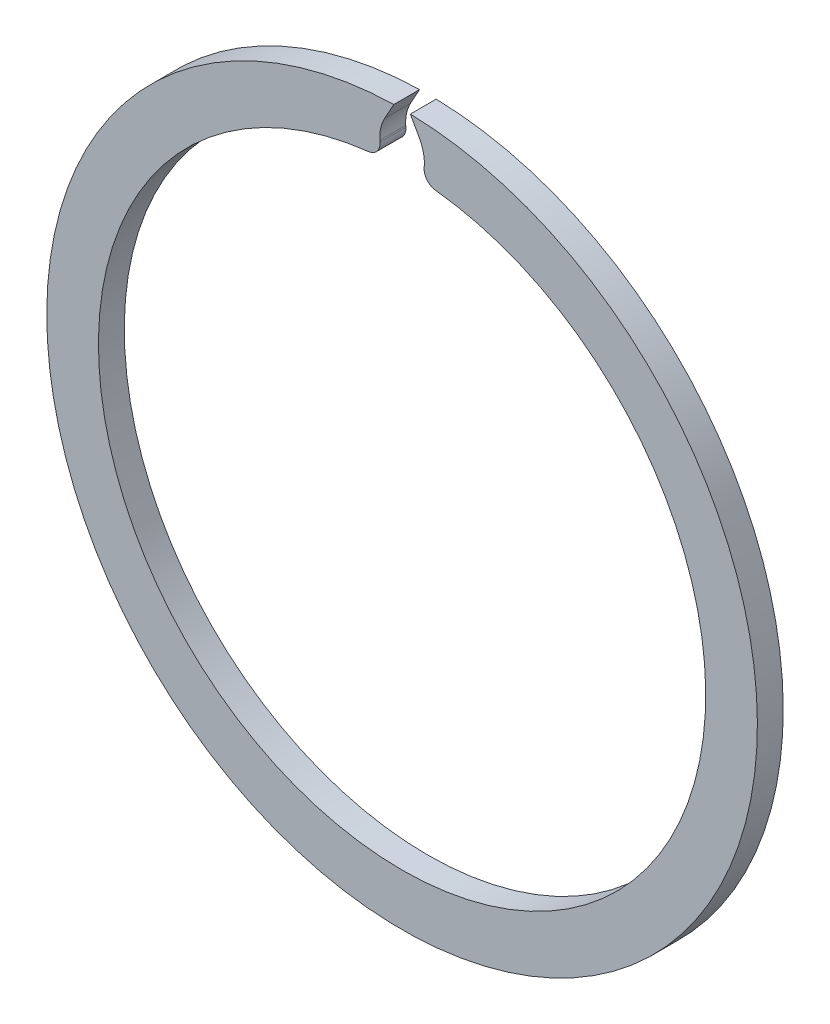
ISO-10303-21;
HEADER;
FILE_DESCRIPTION(('STEP AP214'),'2;1');
FILE_NAME('part.step','',(''),(''),'','','');
FILE_SCHEMA(('AUTOMOTIVE_DESIGN { 1 0 10303 214 1 1 1 1 }'));
ENDSEC;
DATA;
#1=APPLICATION_CONTEXT('core data for automotive mechanical design processes');
#2=APPLICATION_PROTOCOL_DEFINITION('international standard','automotive_design',2000,#1);
#3=PRODUCT_CONTEXT('',#1,'mechanical');
#4=PRODUCT('Part','Part','',(#3));
#5=PRODUCT_RELATED_PRODUCT_CATEGORY('part','',(#4));
#6=PRODUCT_DEFINITION_FORMATION('','',#4);
#7=PRODUCT_DEFINITION_CONTEXT('part definition',#1,'design');
#8=PRODUCT_DEFINITION('design','',#6,#7);
#9=PRODUCT_DEFINITION_SHAPE('','',#8);
#10=(LENGTH_UNIT() NAMED_UNIT(*) SI_UNIT(.MILLI.,.METRE.));
#11=(NAMED_UNIT(*) PLANE_ANGLE_UNIT() SI_UNIT($,.RADIAN.));
#12=(NAMED_UNIT(*) SI_UNIT($,.STERADIAN.) SOLID_ANGLE_UNIT());
#13=UNCERTAINTY_MEASURE_WITH_UNIT(LENGTH_MEASURE(1.E-05),#10,'distance_accuracy_value','');
#14=(GEOMETRIC_REPRESENTATION_CONTEXT(3) GLOBAL_UNCERTAINTY_ASSIGNED_CONTEXT((#13)) GLOBAL_UNIT_ASSIGNED_CONTEXT((#10,
#11,#12)) REPRESENTATION_CONTEXT('',''));
#15=CARTESIAN_POINT('',(0.,0.,0.));
#16=DIRECTION('',(0.,0.,1.));
#17=DIRECTION('',(1.,0.,0.));
#18=AXIS2_PLACEMENT_3D('',#15,#16,#17);
#19=CARTESIAN_POINT('',(-2.70517346207127,24.3501958213914,2.));
#20=DIRECTION('',(0.,0.,-1.));
#21=DIRECTION('',(-1.,0.,0.));
#22=AXIS2_PLACEMENT_3D('',#19,#20,#21);
#23=CYLINDRICAL_SURFACE('',#22,1.);
#24=CARTESIAN_POINT('',(-2.70517346207127,24.3501958213914,0.));
#25=DIRECTION('',(0.,0.,1.));
#26=DIRECTION('',(-1.,0.,0.));
#27=AXIS2_PLACEMENT_3D('',#24,#25,#26);
#28=CIRCLE('',#27,1.);
#29=CARTESIAN_POINT('',(-2.59475821872142,23.3563102776611,0.));
#30=VERTEX_POINT('',#29);
#31=CARTESIAN_POINT('',(-1.70760941181144,24.4199522951355,0.));
#32=VERTEX_POINT('',#31);
#33=EDGE_CURVE('E141',#30,#32,#28,.T.);
#34=ORIENTED_EDGE('',*,*,#33,.T.);
#35=DIRECTION('',(0.,0.,-1.));
#36=VECTOR('',#35,1.);
#37=CARTESIAN_POINT('',(-1.70760941181144,24.4199522951355,2.));
#38=LINE('',#37,#36);
#39=CARTESIAN_POINT('',(-1.70760941181144,24.4199522951355,2.));
#40=VERTEX_POINT('',#39);
#41=EDGE_CURVE('E11',#40,#32,#38,.T.);
#42=ORIENTED_EDGE('',*,*,#41,.F.);
#43=CARTESIAN_POINT('',(-2.70517346207127,24.3501958213914,2.));
#44=DIRECTION('',(0.,0.,1.));
#45=DIRECTION('',(-1.,0.,0.));
#46=AXIS2_PLACEMENT_3D('',#43,#44,#45);
#47=CIRCLE('',#46,1.);
#48=CARTESIAN_POINT('',(-2.59475821872142,23.3563102776611,2.));
#49=VERTEX_POINT('',#48);
#50=EDGE_CURVE('E159',#49,#40,#47,.T.);
#51=ORIENTED_EDGE('',*,*,#50,.F.);
#52=DIRECTION('',(0.,0.,-1.));
#53=VECTOR('',#52,1.);
#54=CARTESIAN_POINT('',(-2.59475821872142,23.3563102776611,2.));
#55=LINE('',#54,#53);
#56=EDGE_CURVE('E137',#49,#30,#55,.T.);
#57=ORIENTED_EDGE('',*,*,#56,.T.);
#58=EDGE_LOOP('',(#34,#42,#51,#57));
#59=FACE_BOUND('',#58,.T.);
#60=ADVANCED_FACE('F33',(#59),#23,.T.);
#61=CARTESIAN_POINT('',(-1.70760941181144,24.4199522951355,2.));
#62=DIRECTION('',(-0.997564050259824,-0.069756473744125,0.));
#63=DIRECTION('',(0.069756473744125,-0.997564050259824,0.));
#64=AXIS2_PLACEMENT_3D('',#61,#62,#63);
#65=PLANE('',#64);
#66=DIRECTION('',(-0.069756473744125,0.997564050259824,0.));
#67=VECTOR('',#66,1.);
#68=CARTESIAN_POINT('',(-1.70760941181144,24.4199522951355,0.));
#69=LINE('',#68,#67);
#70=CARTESIAN_POINT('',(-1.71680165382327,24.5514074802975,0.));
#71=VERTEX_POINT('',#70);
#72=EDGE_CURVE('E144',#32,#71,#69,.T.);
#73=ORIENTED_EDGE('',*,*,#72,.T.);
#74=DIRECTION('',(0.,0.,-1.));
#75=VECTOR('',#74,1.);
#76=CARTESIAN_POINT('',(-1.71680165382327,24.5514074802975,2.));
#77=LINE('',#76,#75);
#78=CARTESIAN_POINT('',(-1.71680165382327,24.5514074802975,2.));
#79=VERTEX_POINT('',#78);
#80=EDGE_CURVE('E41',#79,#71,#77,.T.);
#81=ORIENTED_EDGE('',*,*,#80,.F.);
#82=DIRECTION('',(-0.069756473744125,0.997564050259824,0.));
#83=VECTOR('',#82,1.);
#84=CARTESIAN_POINT('',(-1.70760941181144,24.4199522951355,2.));
#85=LINE('',#84,#83);
#86=EDGE_CURVE('E98',#40,#79,#85,.T.);
#87=ORIENTED_EDGE('',*,*,#86,.F.);
#88=ORIENTED_EDGE('',*,*,#41,.T.);
#89=EDGE_LOOP('',(#73,#81,#87,#88));
#90=FACE_BOUND('',#89,.T.);
#91=ADVANCED_FACE('F208',(#90),#65,.F.);
#92=CARTESIAN_POINT('',(1.2758904969562,24.7606769015299,2.));
#93=DIRECTION('',(0.,0.,-1.));
#94=DIRECTION('',(-1.,0.,0.));
#95=AXIS2_PLACEMENT_3D('',#92,#93,#94);
#96=CYLINDRICAL_SURFACE('',#95,3.);
#97=CARTESIAN_POINT('',(1.2758904969562,24.7606769015299,0.));
#98=DIRECTION('',(0.,0.,-1.));
#99=DIRECTION('',(1.,0.,0.));
#100=AXIS2_PLACEMENT_3D('',#97,#98,#99);
#101=CIRCLE('',#100,3.);
#102=CARTESIAN_POINT('',(-1.34796862446198,26.2151057622689,0.));
#103=VERTEX_POINT('',#102);
#104=EDGE_CURVE('E146',#71,#103,#101,.T.);
#105=ORIENTED_EDGE('',*,*,#104,.T.);
#106=DIRECTION('',(0.,0.,-1.));
#107=VECTOR('',#106,1.);
#108=CARTESIAN_POINT('',(-1.34796862446198,26.2151057622689,2.));
#109=LINE('',#108,#107);
#110=CARTESIAN_POINT('',(-1.34796862446198,26.2151057622689,2.));
#111=VERTEX_POINT('',#110);
#112=EDGE_CURVE('E172',#111,#103,#109,.T.);
#113=ORIENTED_EDGE('',*,*,#112,.F.);
#114=CARTESIAN_POINT('',(1.2758904969562,24.7606769015299,2.));
#115=DIRECTION('',(0.,0.,-1.));
#116=DIRECTION('',(1.,0.,0.));
#117=AXIS2_PLACEMENT_3D('',#114,#115,#116);
#118=CIRCLE('',#117,3.);
#119=EDGE_CURVE('E180',#79,#111,#118,.T.);
#120=ORIENTED_EDGE('',*,*,#119,.F.);
#121=ORIENTED_EDGE('',*,*,#80,.T.);
#122=EDGE_LOOP('',(#105,#113,#120,#121));
#123=FACE_BOUND('',#122,.T.);
#124=ADVANCED_FACE('F178',(#123),#96,.F.);
#125=CARTESIAN_POINT('',(-1.34796862446198,26.2151057622689,2.));
#126=DIRECTION('',(-0.874619707139396,0.484809620246337,0.));
#127=DIRECTION('',(-0.484809620246338,-0.874619707139396,0.));
#128=AXIS2_PLACEMENT_3D('',#125,#126,#127);
#129=PLANE('',#128);
#130=DIRECTION('',(0.484809620246337,0.874619707139396,0.));
#131=VECTOR('',#130,1.);
#132=CARTESIAN_POINT('',(-1.34796862446198,26.2151057622689,0.));
#133=LINE('',#132,#131);
#134=CARTESIAN_POINT('',(-0.639867052781734,27.4925548131629,0.));
#135=VERTEX_POINT('',#134);
#136=EDGE_CURVE('E148',#103,#135,#133,.T.);
#137=ORIENTED_EDGE('',*,*,#136,.T.);
#138=DIRECTION('',(0.,0.,-1.));
#139=VECTOR('',#138,1.);
#140=CARTESIAN_POINT('',(-0.639867052781734,27.4925548131629,2.));
#141=LINE('',#140,#139);
#142=CARTESIAN_POINT('',(-0.639867052781734,27.4925548131629,2.));
#143=VERTEX_POINT('',#142);
#144=EDGE_CURVE('E169',#143,#135,#141,.T.);
#145=ORIENTED_EDGE('',*,*,#144,.F.);
#146=DIRECTION('',(0.484809620246337,0.874619707139396,0.));
#147=VECTOR('',#146,1.);
#148=CARTESIAN_POINT('',(-1.34796862446198,26.2151057622689,2.));
#149=LINE('',#148,#147);
#150=EDGE_CURVE('E198',#111,#143,#149,.T.);
#151=ORIENTED_EDGE('',*,*,#150,.F.);
#152=ORIENTED_EDGE('',*,*,#112,.T.);
#153=EDGE_LOOP('',(#137,#145,#151,#152));
#154=FACE_BOUND('',#153,.T.);
#155=ADVANCED_FACE('F189',(#154),#129,.F.);
#156=CARTESIAN_POINT('',(0.,0.,2.));
#157=DIRECTION('',(0.,0.,-1.));
#158=DIRECTION('',(-1.,0.,0.));
#159=AXIS2_PLACEMENT_3D('',#156,#157,#158);
#160=CYLINDRICAL_SURFACE('',#159,27.5);
#161=CARTESIAN_POINT('',(0.,0.,0.));
#162=DIRECTION('',(0.,0.,1.));
#163=DIRECTION('',(1.,0.,0.));
#164=AXIS2_PLACEMENT_3D('',#161,#162,#163);
#165=CIRCLE('',#164,27.5);
#166=CARTESIAN_POINT('',(0.639867052781737,27.4925548131629,0.));
#167=VERTEX_POINT('',#166);
#168=EDGE_CURVE('E150',#135,#167,#165,.T.);
#169=ORIENTED_EDGE('',*,*,#168,.T.);
#170=DIRECTION('',(0.,0.,-1.));
#171=VECTOR('',#170,1.);
#172=CARTESIAN_POINT('',(0.639867052781737,27.4925548131629,2.));
#173=LINE('',#172,#171);
#174=CARTESIAN_POINT('',(0.639867052781737,27.4925548131629,2.));
#175=VERTEX_POINT('',#174);
#176=EDGE_CURVE('E166',#175,#167,#173,.T.);
#177=ORIENTED_EDGE('',*,*,#176,.F.);
#178=CARTESIAN_POINT('',(0.,0.,2.));
#179=DIRECTION('',(0.,0.,1.));
#180=DIRECTION('',(1.,0.,0.));
#181=AXIS2_PLACEMENT_3D('',#178,#179,#180);
#182=CIRCLE('',#181,27.5);
#183=EDGE_CURVE('E195',#143,#175,#182,.T.);
#184=ORIENTED_EDGE('',*,*,#183,.F.);
#185=ORIENTED_EDGE('',*,*,#144,.T.);
#186=EDGE_LOOP('',(#169,#177,#184,#185));
#187=FACE_BOUND('',#186,.T.);
#188=ADVANCED_FACE('F193',(#187),#160,.T.);
#189=CARTESIAN_POINT('',(1.34796862446198,26.2151057622689,2.));
#190=DIRECTION('',(0.874619707139396,0.484809620246337,0.));
#191=DIRECTION('',(-0.484809620246338,0.874619707139396,0.));
#192=AXIS2_PLACEMENT_3D('',#189,#190,#191);
#193=PLANE('',#192);
#194=DIRECTION('',(0.484809620246337,-0.874619707139396,0.));
#195=VECTOR('',#194,1.);
#196=CARTESIAN_POINT('',(1.34796862446198,26.2151057622689,0.));
#197=LINE('',#196,#195);
#198=CARTESIAN_POINT('',(1.34796862446198,26.2151057622689,0.));
#199=VERTEX_POINT('',#198);
#200=EDGE_CURVE('E152',#167,#199,#197,.T.);
#201=ORIENTED_EDGE('',*,*,#200,.T.);
#202=DIRECTION('',(0.,0.,-1.));
#203=VECTOR('',#202,1.);
#204=CARTESIAN_POINT('',(1.34796862446198,26.2151057622689,2.));
#205=LINE('',#204,#203);
#206=CARTESIAN_POINT('',(1.34796862446198,26.2151057622689,2.));
#207=VERTEX_POINT('',#206);
#208=EDGE_CURVE('E163',#207,#199,#205,.T.);
#209=ORIENTED_EDGE('',*,*,#208,.F.);
#210=DIRECTION('',(0.484809620246337,-0.874619707139396,0.));
#211=VECTOR('',#210,1.);
#212=CARTESIAN_POINT('',(1.34796862446198,26.2151057622689,2.));
#213=LINE('',#212,#211);
#214=EDGE_CURVE('E197',#175,#207,#213,.T.);
#215=ORIENTED_EDGE('',*,*,#214,.F.);
#216=ORIENTED_EDGE('',*,*,#176,.T.);
#217=EDGE_LOOP('',(#201,#209,#215,#216));
#218=FACE_BOUND('',#217,.T.);
#219=ADVANCED_FACE('F220',(#218),#193,.F.);
#220=CARTESIAN_POINT('',(-1.2758904969562,24.7606769015299,2.));
#221=DIRECTION('',(0.,0.,-1.));
#222=DIRECTION('',(-1.,0.,0.));
#223=AXIS2_PLACEMENT_3D('',#220,#221,#222);
#224=CYLINDRICAL_SURFACE('',#223,3.);
#225=CARTESIAN_POINT('',(-1.2758904969562,24.7606769015299,0.));
#226=DIRECTION('',(0.,0.,-1.));
#227=DIRECTION('',(-1.,0.,0.));
#228=AXIS2_PLACEMENT_3D('',#225,#226,#227);
#229=CIRCLE('',#228,3.);
#230=CARTESIAN_POINT('',(1.71680165382327,24.5514074802975,0.));
#231=VERTEX_POINT('',#230);
#232=EDGE_CURVE('E154',#199,#231,#229,.T.);
#233=ORIENTED_EDGE('',*,*,#232,.T.);
#234=DIRECTION('',(0.,0.,-1.));
#235=VECTOR('',#234,1.);
#236=CARTESIAN_POINT('',(1.71680165382327,24.5514074802975,2.));
#237=LINE('',#236,#235);
#238=CARTESIAN_POINT('',(1.71680165382327,24.5514074802975,2.));
#239=VERTEX_POINT('',#238);
#240=EDGE_CURVE('E132',#239,#231,#237,.T.);
#241=ORIENTED_EDGE('',*,*,#240,.F.);
#242=CARTESIAN_POINT('',(-1.2758904969562,24.7606769015299,2.));
#243=DIRECTION('',(0.,0.,-1.));
#244=DIRECTION('',(-1.,0.,0.));
#245=AXIS2_PLACEMENT_3D('',#242,#243,#244);
#246=CIRCLE('',#245,3.);
#247=EDGE_CURVE('E123',#207,#239,#246,.T.);
#248=ORIENTED_EDGE('',*,*,#247,.F.);
#249=ORIENTED_EDGE('',*,*,#208,.T.);
#250=EDGE_LOOP('',(#233,#241,#248,#249));
#251=FACE_BOUND('',#250,.T.);
#252=ADVANCED_FACE('F223',(#251),#224,.F.);
#253=CARTESIAN_POINT('',(1.70760941181144,24.4199522951355,2.));
#254=DIRECTION('',(0.997564050259824,-0.069756473744125,0.));
#255=DIRECTION('',(0.069756473744125,0.997564050259824,0.));
#256=AXIS2_PLACEMENT_3D('',#253,#254,#255);
#257=PLANE('',#256);
#258=DIRECTION('',(-0.069756473744125,-0.997564050259824,0.));
#259=VECTOR('',#258,1.);
#260=CARTESIAN_POINT('',(1.70760941181144,24.4199522951355,0.));
#261=LINE('',#260,#259);
#262=CARTESIAN_POINT('',(1.70760941181144,24.4199522951355,0.));
#263=VERTEX_POINT('',#262);
#264=EDGE_CURVE('E131',#231,#263,#261,.T.);
#265=ORIENTED_EDGE('',*,*,#264,.T.);
#266=DIRECTION('',(0.,0.,-1.));
#267=VECTOR('',#266,1.);
#268=CARTESIAN_POINT('',(1.70760941181144,24.4199522951355,2.));
#269=LINE('',#268,#267);
#270=CARTESIAN_POINT('',(1.70760941181144,24.4199522951355,2.));
#271=VERTEX_POINT('',#270);
#272=EDGE_CURVE('E128',#271,#263,#269,.T.);
#273=ORIENTED_EDGE('',*,*,#272,.F.);
#274=DIRECTION('',(-0.069756473744125,-0.997564050259824,0.));
#275=VECTOR('',#274,1.);
#276=CARTESIAN_POINT('',(1.70760941181144,24.4199522951355,2.));
#277=LINE('',#276,#275);
#278=EDGE_CURVE('E117',#239,#271,#277,.T.);
#279=ORIENTED_EDGE('',*,*,#278,.F.);
#280=ORIENTED_EDGE('',*,*,#240,.T.);
#281=EDGE_LOOP('',(#265,#273,#279,#280));
#282=FACE_BOUND('',#281,.T.);
#283=ADVANCED_FACE('F129',(#282),#257,.F.);
#284=CARTESIAN_POINT('',(2.70517346207127,24.3501958213914,2.));
#285=DIRECTION('',(0.,0.,-1.));
#286=DIRECTION('',(-1.,0.,0.));
#287=AXIS2_PLACEMENT_3D('',#284,#285,#286);
#288=CYLINDRICAL_SURFACE('',#287,0.999999999999999);
#289=CARTESIAN_POINT('',(2.70517346207127,24.3501958213914,0.));
#290=DIRECTION('',(0.,0.,1.));
#291=DIRECTION('',(1.,0.,0.));
#292=AXIS2_PLACEMENT_3D('',#289,#290,#291);
#293=CIRCLE('',#292,0.999999999999999);
#294=CARTESIAN_POINT('',(2.59475821872142,23.3563102776611,0.));
#295=VERTEX_POINT('',#294);
#296=EDGE_CURVE('E84',#263,#295,#293,.T.);
#297=ORIENTED_EDGE('',*,*,#296,.T.);
#298=DIRECTION('',(0.,0.,-1.));
#299=VECTOR('',#298,1.);
#300=CARTESIAN_POINT('',(2.59475821872142,23.3563102776611,2.));
#301=LINE('',#300,#299);
#302=CARTESIAN_POINT('',(2.59475821872142,23.3563102776611,2.));
#303=VERTEX_POINT('',#302);
#304=EDGE_CURVE('E133',#303,#295,#301,.T.);
#305=ORIENTED_EDGE('',*,*,#304,.F.);
#306=CARTESIAN_POINT('',(2.70517346207127,24.3501958213914,2.));
#307=DIRECTION('',(0.,0.,1.));
#308=DIRECTION('',(1.,0.,0.));
#309=AXIS2_PLACEMENT_3D('',#306,#307,#308);
#310=CIRCLE('',#309,0.999999999999999);
#311=EDGE_CURVE('E121',#271,#303,#310,.T.);
#312=ORIENTED_EDGE('',*,*,#311,.F.);
#313=ORIENTED_EDGE('',*,*,#272,.T.);
#314=EDGE_LOOP('',(#297,#305,#312,#313));
#315=FACE_BOUND('',#314,.T.);
#316=ADVANCED_FACE('F135',(#315),#288,.T.);
#317=CARTESIAN_POINT('',(0.,0.,2.));
#318=DIRECTION('',(0.,0.,-1.));
#319=DIRECTION('',(-1.,0.,0.));
#320=AXIS2_PLACEMENT_3D('',#317,#318,#319);
#321=CYLINDRICAL_SURFACE('',#320,23.5);
#322=CARTESIAN_POINT('',(0.,0.,0.));
#323=DIRECTION('',(0.,0.,-1.));
#324=DIRECTION('',(1.,0.,0.));
#325=AXIS2_PLACEMENT_3D('',#322,#323,#324);
#326=CIRCLE('',#325,23.5);
#327=EDGE_CURVE('E90',#295,#30,#326,.T.);
#328=ORIENTED_EDGE('',*,*,#327,.T.);
#329=ORIENTED_EDGE('',*,*,#56,.F.);
#330=CARTESIAN_POINT('',(0.,0.,2.));
#331=DIRECTION('',(0.,0.,-1.));
#332=DIRECTION('',(1.,0.,0.));
#333=AXIS2_PLACEMENT_3D('',#330,#331,#332);
#334=CIRCLE('',#333,23.5);
#335=EDGE_CURVE('E49',#303,#49,#334,.T.);
#336=ORIENTED_EDGE('',*,*,#335,.F.);
#337=ORIENTED_EDGE('',*,*,#304,.T.);
#338=EDGE_LOOP('',(#328,#329,#336,#337));
#339=FACE_BOUND('',#338,.T.);
#340=ADVANCED_FACE('F232',(#339),#321,.F.);
#341=CARTESIAN_POINT('',(-2.70517346207127,24.3501958213914,2.));
#342=DIRECTION('',(0.,0.,-1.));
#343=DIRECTION('',(-1.,0.,0.));
#344=AXIS2_PLACEMENT_3D('',#341,#342,#343);
#345=PLANE('',#344);
#346=ORIENTED_EDGE('',*,*,#50,.T.);
#347=ORIENTED_EDGE('',*,*,#86,.T.);
#348=ORIENTED_EDGE('',*,*,#119,.T.);
#349=ORIENTED_EDGE('',*,*,#150,.T.);
#350=ORIENTED_EDGE('',*,*,#183,.T.);
#351=ORIENTED_EDGE('',*,*,#214,.T.);
#352=ORIENTED_EDGE('',*,*,#247,.T.);
#353=ORIENTED_EDGE('',*,*,#278,.T.);
#354=ORIENTED_EDGE('',*,*,#311,.T.);
#355=ORIENTED_EDGE('',*,*,#335,.T.);
#356=EDGE_LOOP('',(#346,#347,#348,#349,#350,#351,#352,#353,#354,#355));
#357=FACE_BOUND('',#356,.T.);
#358=ADVANCED_FACE('F119',(#357),#345,.F.);
#359=CARTESIAN_POINT('',(-2.70517346207127,24.3501958213914,0.));
#360=DIRECTION('',(0.,0.,-1.));
#361=DIRECTION('',(-1.,0.,0.));
#362=AXIS2_PLACEMENT_3D('',#359,#360,#361);
#363=PLANE('',#362);
#364=ORIENTED_EDGE('',*,*,#33,.F.);
#365=ORIENTED_EDGE('',*,*,#327,.F.);
#366=ORIENTED_EDGE('',*,*,#296,.F.);
#367=ORIENTED_EDGE('',*,*,#264,.F.);
#368=ORIENTED_EDGE('',*,*,#232,.F.);
#369=ORIENTED_EDGE('',*,*,#200,.F.);
#370=ORIENTED_EDGE('',*,*,#168,.F.);
#371=ORIENTED_EDGE('',*,*,#136,.F.);
#372=ORIENTED_EDGE('',*,*,#104,.F.);
#373=ORIENTED_EDGE('',*,*,#72,.F.);
#374=EDGE_LOOP('',(#364,#365,#366,#367,#368,#369,#370,#371,#372,#373));
#375=FACE_BOUND('',#374,.T.);
#376=ADVANCED_FACE('F184',(#375),#363,.T.);
#377=CLOSED_SHELL('',(#60,#91,#124,#155,#188,#219,#252,#283,#316,#340,#358,#376));
#378=MANIFOLD_SOLID_BREP('B2',#377);
#379=ADVANCED_BREP_SHAPE_REPRESENTATION('',(#18,#378),#14);
#380=SHAPE_DEFINITION_REPRESENTATION(#9,#379);
ENDSEC;
END-ISO-10303-21;
